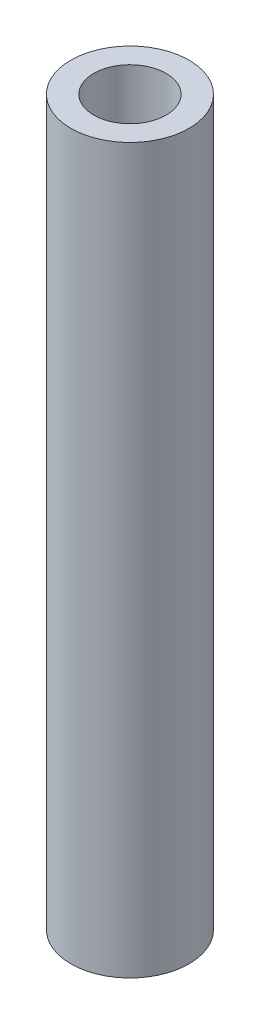
ISO-10303-21;
HEADER;
FILE_DESCRIPTION(('STEP AP214'),'2;1');
FILE_NAME('part.step','',(''),(''),'','','');
FILE_SCHEMA(('AUTOMOTIVE_DESIGN { 1 0 10303 214 1 1 1 1 }'));
ENDSEC;
DATA;
#1=APPLICATION_CONTEXT('core data for automotive mechanical design processes');
#2=APPLICATION_PROTOCOL_DEFINITION('international standard','automotive_design',2000,#1);
#3=PRODUCT_CONTEXT('',#1,'mechanical');
#4=PRODUCT('Part','Part','',(#3));
#5=PRODUCT_RELATED_PRODUCT_CATEGORY('part','',(#4));
#6=PRODUCT_DEFINITION_FORMATION('','',#4);
#7=PRODUCT_DEFINITION_CONTEXT('part definition',#1,'design');
#8=PRODUCT_DEFINITION('design','',#6,#7);
#9=PRODUCT_DEFINITION_SHAPE('','',#8);
#10=(LENGTH_UNIT() NAMED_UNIT(*) SI_UNIT(.MILLI.,.METRE.));
#11=(NAMED_UNIT(*) PLANE_ANGLE_UNIT() SI_UNIT($,.RADIAN.));
#12=(NAMED_UNIT(*) SI_UNIT($,.STERADIAN.) SOLID_ANGLE_UNIT());
#13=UNCERTAINTY_MEASURE_WITH_UNIT(LENGTH_MEASURE(1.E-05),#10,'distance_accuracy_value','');
#14=(GEOMETRIC_REPRESENTATION_CONTEXT(3) GLOBAL_UNCERTAINTY_ASSIGNED_CONTEXT((#13)) GLOBAL_UNIT_ASSIGNED_CONTEXT((#10,
#11,#12)) REPRESENTATION_CONTEXT('',''));
#15=CARTESIAN_POINT('',(0.,0.,0.));
#16=DIRECTION('',(0.,0.,1.));
#17=DIRECTION('',(1.,0.,0.));
#18=AXIS2_PLACEMENT_3D('',#15,#16,#17);
#19=CARTESIAN_POINT('',(0.,30.,0.));
#20=DIRECTION('',(0.,1.,0.));
#21=DIRECTION('',(0.,0.,1.));
#22=AXIS2_PLACEMENT_3D('',#19,#20,#21);
#23=PLANE('',#22);
#24=CARTESIAN_POINT('',(0.,30.,0.));
#25=DIRECTION('',(0.,1.,0.));
#26=DIRECTION('',(0.,0.,1.));
#27=AXIS2_PLACEMENT_3D('',#24,#25,#26);
#28=CIRCLE('',#27,2.45);
#29=CARTESIAN_POINT('',(0.,30.,2.45));
#30=VERTEX_POINT('',#29);
#31=EDGE_CURVE('E10',#30,#30,#28,.T.);
#32=ORIENTED_EDGE('',*,*,#31,.T.);
#33=EDGE_LOOP('',(#32));
#34=FACE_BOUND('',#33,.T.);
#35=CARTESIAN_POINT('',(0.,30.,0.));
#36=DIRECTION('',(0.,1.,0.));
#37=DIRECTION('',(0.,0.,1.));
#38=AXIS2_PLACEMENT_3D('',#35,#36,#37);
#39=CIRCLE('',#38,1.5);
#40=CARTESIAN_POINT('',(0.,30.,1.5));
#41=VERTEX_POINT('',#40);
#42=EDGE_CURVE('E42',#41,#41,#39,.T.);
#43=ORIENTED_EDGE('',*,*,#42,.F.);
#44=EDGE_LOOP('',(#43));
#45=FACE_BOUND('',#44,.T.);
#46=ADVANCED_FACE('F31',(#34,#45),#23,.T.);
#47=CARTESIAN_POINT('',(0.,0.,0.));
#48=DIRECTION('',(0.,1.,0.));
#49=DIRECTION('',(0.,0.,1.));
#50=AXIS2_PLACEMENT_3D('',#47,#48,#49);
#51=PLANE('',#50);
#52=CARTESIAN_POINT('',(0.,0.,0.));
#53=DIRECTION('',(0.,1.,0.));
#54=DIRECTION('',(0.,0.,1.));
#55=AXIS2_PLACEMENT_3D('',#52,#53,#54);
#56=CIRCLE('',#55,2.45);
#57=CARTESIAN_POINT('',(0.,0.,2.45));
#58=VERTEX_POINT('',#57);
#59=EDGE_CURVE('E35',#58,#58,#56,.T.);
#60=ORIENTED_EDGE('',*,*,#59,.F.);
#61=EDGE_LOOP('',(#60));
#62=FACE_BOUND('',#61,.T.);
#63=CARTESIAN_POINT('',(0.,0.,0.));
#64=DIRECTION('',(0.,1.,0.));
#65=DIRECTION('',(0.,0.,1.));
#66=AXIS2_PLACEMENT_3D('',#63,#64,#65);
#67=CIRCLE('',#66,1.5);
#68=CARTESIAN_POINT('',(0.,0.,1.5));
#69=VERTEX_POINT('',#68);
#70=EDGE_CURVE('E44',#69,#69,#67,.T.);
#71=ORIENTED_EDGE('',*,*,#70,.T.);
#72=EDGE_LOOP('',(#71));
#73=FACE_BOUND('',#72,.T.);
#74=ADVANCED_FACE('F54',(#62,#73),#51,.F.);
#75=CARTESIAN_POINT('',(0.,30.,0.));
#76=DIRECTION('',(0.,-1.,0.));
#77=DIRECTION('',(0.,0.,-1.));
#78=AXIS2_PLACEMENT_3D('',#75,#76,#77);
#79=CYLINDRICAL_SURFACE('',#78,2.45);
#80=ORIENTED_EDGE('',*,*,#31,.F.);
#81=EDGE_LOOP('',(#80));
#82=FACE_BOUND('',#81,.T.);
#83=ORIENTED_EDGE('',*,*,#59,.T.);
#84=EDGE_LOOP('',(#83));
#85=FACE_BOUND('',#84,.T.);
#86=ADVANCED_FACE('F33',(#82,#85),#79,.T.);
#87=CARTESIAN_POINT('',(0.,30.,0.));
#88=DIRECTION('',(0.,-1.,0.));
#89=DIRECTION('',(0.,0.,-1.));
#90=AXIS2_PLACEMENT_3D('',#87,#88,#89);
#91=CYLINDRICAL_SURFACE('',#90,1.5);
#92=ORIENTED_EDGE('',*,*,#42,.T.);
#93=EDGE_LOOP('',(#92));
#94=FACE_BOUND('',#93,.T.);
#95=ORIENTED_EDGE('',*,*,#70,.F.);
#96=EDGE_LOOP('',(#95));
#97=FACE_BOUND('',#96,.T.);
#98=ADVANCED_FACE('F50',(#94,#97),#91,.F.);
#99=CLOSED_SHELL('',(#46,#74,#86,#98));
#100=MANIFOLD_SOLID_BREP('B2',#99);
#101=ADVANCED_BREP_SHAPE_REPRESENTATION('',(#18,#100),#14);
#102=SHAPE_DEFINITION_REPRESENTATION(#9,#101);
ENDSEC;
END-ISO-10303-21;
